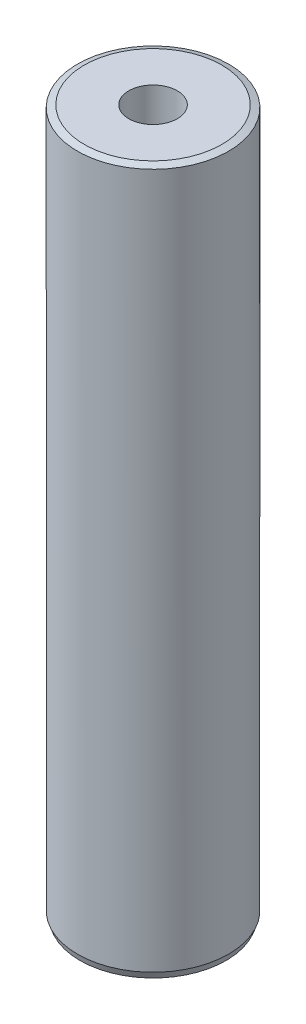
ISO-10303-21;
HEADER;
FILE_DESCRIPTION(('STEP AP214'),'2;1');
FILE_NAME('part.step','',(''),(''),'','','');
FILE_SCHEMA(('AUTOMOTIVE_DESIGN { 1 0 10303 214 1 1 1 1 }'));
ENDSEC;
DATA;
#1=APPLICATION_CONTEXT('core data for automotive mechanical design processes');
#2=APPLICATION_PROTOCOL_DEFINITION('international standard','automotive_design',2000,#1);
#3=PRODUCT_CONTEXT('',#1,'mechanical');
#4=PRODUCT('Part','Part','',(#3));
#5=PRODUCT_RELATED_PRODUCT_CATEGORY('part','',(#4));
#6=PRODUCT_DEFINITION_FORMATION('','',#4);
#7=PRODUCT_DEFINITION_CONTEXT('part definition',#1,'design');
#8=PRODUCT_DEFINITION('design','',#6,#7);
#9=PRODUCT_DEFINITION_SHAPE('','',#8);
#10=(LENGTH_UNIT() NAMED_UNIT(*) SI_UNIT(.MILLI.,.METRE.));
#11=(NAMED_UNIT(*) PLANE_ANGLE_UNIT() SI_UNIT($,.RADIAN.));
#12=(NAMED_UNIT(*) SI_UNIT($,.STERADIAN.) SOLID_ANGLE_UNIT());
#13=UNCERTAINTY_MEASURE_WITH_UNIT(LENGTH_MEASURE(1.E-05),#10,'distance_accuracy_value','');
#14=(GEOMETRIC_REPRESENTATION_CONTEXT(3) GLOBAL_UNCERTAINTY_ASSIGNED_CONTEXT((#13)) GLOBAL_UNIT_ASSIGNED_CONTEXT((#10,
#11,#12)) REPRESENTATION_CONTEXT('',''));
#15=CARTESIAN_POINT('',(0.,0.,0.));
#16=DIRECTION('',(0.,0.,1.));
#17=DIRECTION('',(1.,0.,0.));
#18=AXIS2_PLACEMENT_3D('',#15,#16,#17);
#19=CARTESIAN_POINT('',(0.,442.975530830093,0.));
#20=DIRECTION('',(0.,-1.,0.));
#21=DIRECTION('',(0.,0.,-1.));
#22=AXIS2_PLACEMENT_3D('',#19,#20,#21);
#23=CYLINDRICAL_SURFACE('',#22,47.5);
#24=CARTESIAN_POINT('',(0.,441.413450480086,0.));
#25=DIRECTION('',(0.,1.,0.));
#26=DIRECTION('',(0.,0.,1.));
#27=AXIS2_PLACEMENT_3D('',#24,#25,#26);
#28=CIRCLE('',#27,47.5);
#29=CARTESIAN_POINT('',(0.,441.413450480086,-47.5000000000001));
#30=VERTEX_POINT('',#29);
#31=EDGE_CURVE('E50',#30,#30,#28,.F.);
#32=ORIENTED_EDGE('',*,*,#31,.T.);
#33=EDGE_LOOP('',(#32));
#34=FACE_BOUND('',#33,.T.);
#35=CARTESIAN_POINT('',(0.,4.25407893752877,0.));
#36=DIRECTION('',(0.,1.,0.));
#37=DIRECTION('',(0.,0.,1.));
#38=AXIS2_PLACEMENT_3D('',#35,#36,#37);
#39=CIRCLE('',#38,47.5);
#40=CARTESIAN_POINT('',(0.,4.25407893752877,47.5));
#41=VERTEX_POINT('',#40);
#42=EDGE_CURVE('E51',#41,#41,#39,.T.);
#43=ORIENTED_EDGE('',*,*,#42,.T.);
#44=EDGE_LOOP('',(#43));
#45=FACE_BOUND('',#44,.T.);
#46=ADVANCED_FACE('F39',(#34,#45),#23,.T.);
#47=CARTESIAN_POINT('',(0.,442.975530830093,0.));
#48=DIRECTION('',(0.,1.,0.));
#49=DIRECTION('',(0.,0.,1.));
#50=AXIS2_PLACEMENT_3D('',#47,#48,#49);
#51=PLANE('',#50);
#52=CARTESIAN_POINT('',(0.,442.975530830093,0.));
#53=DIRECTION('',(0.,1.,0.));
#54=DIRECTION('',(0.,0.,1.));
#55=AXIS2_PLACEMENT_3D('',#52,#53,#54);
#56=CIRCLE('',#55,43.2459210624717);
#57=CARTESIAN_POINT('',(0.,442.975530830093,-43.2459210624718));
#58=VERTEX_POINT('',#57);
#59=EDGE_CURVE('E54',#58,#58,#56,.T.);
#60=ORIENTED_EDGE('',*,*,#59,.T.);
#61=EDGE_LOOP('',(#60));
#62=FACE_BOUND('',#61,.T.);
#63=CARTESIAN_POINT('',(0.,442.975530830093,0.));
#64=DIRECTION('',(0.,1.,0.));
#65=DIRECTION('',(0.,0.,1.));
#66=AXIS2_PLACEMENT_3D('',#63,#64,#65);
#67=CIRCLE('',#66,15.2539381624958);
#68=CARTESIAN_POINT('',(0.,442.975530830093,15.2539381624958));
#69=VERTEX_POINT('',#68);
#70=EDGE_CURVE('E58',#69,#69,#67,.T.);
#71=ORIENTED_EDGE('',*,*,#70,.F.);
#72=EDGE_LOOP('',(#71));
#73=FACE_BOUND('',#72,.T.);
#74=ADVANCED_FACE('F69',(#62,#73),#51,.T.);
#75=CARTESIAN_POINT('',(0.,0.,0.));
#76=DIRECTION('',(0.,1.,0.));
#77=DIRECTION('',(0.,0.,1.));
#78=AXIS2_PLACEMENT_3D('',#75,#76,#77);
#79=PLANE('',#78);
#80=CARTESIAN_POINT('',(0.,0.,0.));
#81=DIRECTION('',(0.,1.,0.));
#82=DIRECTION('',(0.,0.,1.));
#83=AXIS2_PLACEMENT_3D('',#80,#81,#82);
#84=CIRCLE('',#83,45.9379196499927);
#85=CARTESIAN_POINT('',(0.,0.,45.9379196499927));
#86=VERTEX_POINT('',#85);
#87=EDGE_CURVE('E10',#86,#86,#84,.F.);
#88=ORIENTED_EDGE('',*,*,#87,.T.);
#89=EDGE_LOOP('',(#88));
#90=FACE_BOUND('',#89,.T.);
#91=CARTESIAN_POINT('',(0.,0.,0.));
#92=DIRECTION('',(0.,1.,0.));
#93=DIRECTION('',(0.,0.,1.));
#94=AXIS2_PLACEMENT_3D('',#91,#92,#93);
#95=CIRCLE('',#94,15.2539381624958);
#96=CARTESIAN_POINT('',(0.,0.,15.2539381624958));
#97=VERTEX_POINT('',#96);
#98=EDGE_CURVE('E63',#97,#97,#95,.T.);
#99=ORIENTED_EDGE('',*,*,#98,.T.);
#100=EDGE_LOOP('',(#99));
#101=FACE_BOUND('',#100,.T.);
#102=ADVANCED_FACE('F75',(#90,#101),#79,.F.);
#103=CARTESIAN_POINT('',(0.,442.975530830093,0.));
#104=DIRECTION('',(0.,-1.,0.));
#105=DIRECTION('',(0.,0.,-1.));
#106=AXIS2_PLACEMENT_3D('',#103,#104,#105);
#107=CYLINDRICAL_SURFACE('',#106,15.2539381624958);
#108=ORIENTED_EDGE('',*,*,#70,.T.);
#109=EDGE_LOOP('',(#108));
#110=FACE_BOUND('',#109,.T.);
#111=ORIENTED_EDGE('',*,*,#98,.F.);
#112=EDGE_LOOP('',(#111));
#113=FACE_BOUND('',#112,.T.);
#114=ADVANCED_FACE('F70',(#110,#113),#107,.F.);
#115=CARTESIAN_POINT('',(0.,442.975530830093,0.));
#116=DIRECTION('',(0.,-1.,0.));
#117=DIRECTION('',(0.,0.,-1.));
#118=AXIS2_PLACEMENT_3D('',#115,#116,#117);
#119=CONICAL_SURFACE('',#118,43.2459210624717,1.21888509817256);
#120=CARTESIAN_POINT('',(0.,441.413450480086,-47.5000000000001));
#121=CARTESIAN_POINT('',(0.,441.429722150399,-47.4556866777342));
#122=CARTESIAN_POINT('',(0.,441.445993820711,-47.4113733554682));
#123=CARTESIAN_POINT('',(0.,441.478537161337,-47.3227467109364));
#124=CARTESIAN_POINT('',(0.,441.494808831649,-47.2784333886705));
#125=CARTESIAN_POINT('',(0.,441.527352172274,-47.1898067441387));
#126=CARTESIAN_POINT('',(0.,441.543623842587,-47.1454934218727));
#127=CARTESIAN_POINT('',(0.,441.576167183212,-47.0568667773409));
#128=CARTESIAN_POINT('',(0.,441.592438853525,-47.012553455075));
#129=CARTESIAN_POINT('',(0.,441.62498219415,-46.9239268105431));
#130=CARTESIAN_POINT('',(0.,441.641253864462,-46.8796134882772));
#131=CARTESIAN_POINT('',(0.,441.673797205088,-46.7909868437454));
#132=CARTESIAN_POINT('',(0.,441.6900688754,-46.7466735214795));
#133=CARTESIAN_POINT('',(0.,441.722612216025,-46.6580468769476));
#134=CARTESIAN_POINT('',(0.,441.738883886338,-46.6137335546817));
#135=CARTESIAN_POINT('',(0.,441.771427226963,-46.5251069101498));
#136=CARTESIAN_POINT('',(0.,441.787698897276,-46.4807935878839));
#137=CARTESIAN_POINT('',(0.,441.820242237901,-46.3921669433521));
#138=CARTESIAN_POINT('',(0.,441.836513908213,-46.3478536210862));
#139=CARTESIAN_POINT('',(0.,441.869057248838,-46.2592269765543));
#140=CARTESIAN_POINT('',(0.,441.885328919151,-46.2149136542884));
#141=CARTESIAN_POINT('',(0.,441.917872259776,-46.1262870097566));
#142=CARTESIAN_POINT('',(0.,441.934143930089,-46.0819736874907));
#143=CARTESIAN_POINT('',(0.,441.966687270714,-45.9933470429588));
#144=CARTESIAN_POINT('',(0.,441.982958941027,-45.9490337206929));
#145=CARTESIAN_POINT('',(0.,442.015502281652,-45.8604070761611));
#146=CARTESIAN_POINT('',(0.,442.031773951964,-45.8160937538951));
#147=CARTESIAN_POINT('',(0.,442.064317292589,-45.7274671093633));
#148=CARTESIAN_POINT('',(0.,442.080588962902,-45.6831537870974));
#149=CARTESIAN_POINT('',(0.,442.113132303527,-45.5945271425655));
#150=CARTESIAN_POINT('',(0.,442.12940397384,-45.5502138202996));
#151=CARTESIAN_POINT('',(0.,442.161947314465,-45.4615871757678));
#152=CARTESIAN_POINT('',(0.,442.178218984777,-45.4172738535019));
#153=CARTESIAN_POINT('',(0.,442.210762325403,-45.32864720897));
#154=CARTESIAN_POINT('',(0.,442.227033995715,-45.2843338867041));
#155=CARTESIAN_POINT('',(0.,442.25957733634,-45.1957072421723));
#156=CARTESIAN_POINT('',(0.,442.275849006653,-45.1513939199063));
#157=CARTESIAN_POINT('',(0.,442.308392347278,-45.0627672753745));
#158=CARTESIAN_POINT('',(0.,442.324664017591,-45.0184539531086));
#159=CARTESIAN_POINT('',(0.,442.357207358216,-44.9298273085767));
#160=CARTESIAN_POINT('',(0.,442.373479028528,-44.8855139863108));
#161=CARTESIAN_POINT('',(0.,442.406022369153,-44.796887341779));
#162=CARTESIAN_POINT('',(0.,442.422294039466,-44.7525740195131));
#163=CARTESIAN_POINT('',(0.,442.454837380091,-44.6639473749812));
#164=CARTESIAN_POINT('',(0.,442.471109050404,-44.6196340527153));
#165=CARTESIAN_POINT('',(0.,442.503652391029,-44.5310074081835));
#166=CARTESIAN_POINT('',(0.,442.519924061341,-44.4866940859175));
#167=CARTESIAN_POINT('',(0.,442.552467401967,-44.3980674413857));
#168=CARTESIAN_POINT('',(0.,442.568739072279,-44.3537541191198));
#169=CARTESIAN_POINT('',(0.,442.601282412904,-44.2651274745879));
#170=CARTESIAN_POINT('',(0.,442.617554083217,-44.220814152322));
#171=CARTESIAN_POINT('',(0.,442.650097423842,-44.1321875077902));
#172=CARTESIAN_POINT('',(0.,442.666369094155,-44.0878741855243));
#173=CARTESIAN_POINT('',(0.,442.69891243478,-43.9992475409924));
#174=CARTESIAN_POINT('',(0.,442.715184105092,-43.9549342187265));
#175=CARTESIAN_POINT('',(0.,442.747727445717,-43.8663075741947));
#176=CARTESIAN_POINT('',(0.,442.76399911603,-43.8219942519287));
#177=CARTESIAN_POINT('',(0.,442.796542456655,-43.7333676073969));
#178=CARTESIAN_POINT('',(0.,442.812814126968,-43.689054285131));
#179=CARTESIAN_POINT('',(0.,442.845357467593,-43.6004276405992));
#180=CARTESIAN_POINT('',(0.,442.861629137905,-43.5561143183332));
#181=CARTESIAN_POINT('',(0.,442.894172478531,-43.4674876738014));
#182=CARTESIAN_POINT('',(0.,442.910444148843,-43.4231743515355));
#183=CARTESIAN_POINT('',(0.,442.942987489468,-43.3345477070036));
#184=CARTESIAN_POINT('',(0.,442.959259159781,-43.2902343847377));
#185=CARTESIAN_POINT('',(0.,442.975530830093,-43.2459210624718));
#186=B_SPLINE_CURVE_WITH_KNOTS('',3,(#120,#121,#122,#123,#124,#125,#126,#127,#128,#129,#130,
#131,#132,#133,#134,#135,#136,#137,#138,#139,#140,#141,#142,#143,#144,#145,#146,#147,#148,#149,
#150,#151,#152,#153,#154,#155,#156,#157,#158,#159,#160,#161,#162,#163,#164,#165,#166,#167,#168,
#169,#170,#171,#172,#173,#174,#175,#176,#177,#178,#179,#180,#181,#182,#183,#184,#185),
.UNSPECIFIED.,.F.,.F.,(4,2,2,2,2,2,2,2,2,2,2,2,2,2,2,2,2,2,2,2,2,2,2,2,2,2,2,2,2,2,2,2,4),(0.,
0.141618996130603,0.283237992261207,0.42485698839181,0.566475984522414,0.708094980653017,
0.849713976783621,0.991332972914212,1.13295196904482,1.27457096517542,1.41618996130602,
1.55780895743663,1.69942795356723,1.84104694969781,1.98266594582842,2.12428494195902,
2.26590393808963,2.40752293422023,2.54914193035084,2.69076092648144,2.83237992261202,
2.97399891874263,3.11561791487323,3.25723691100383,3.39885590713444,3.54047490326504,
3.68209389939563,3.82371289552624,3.96533189165684,4.10695088778744,4.24856988391805,
4.39018888004865,4.53180787617926),.UNSPECIFIED.);
#187=EDGE_CURVE('BSEAM81',#30,#58,#186,.T.);
#188=ORIENTED_EDGE('',*,*,#31,.F.);
#189=ORIENTED_EDGE('',*,*,#59,.F.);
#190=ORIENTED_EDGE('',*,*,#187,.T.);
#191=ORIENTED_EDGE('',*,*,#187,.F.);
#192=EDGE_LOOP('',(#188,#190,#189,#191));
#193=FACE_BOUND('',#192,.T.);
#194=ADVANCED_FACE('F81',(#193),#119,.T.);
#195=CARTESIAN_POINT('',(0.,4.25407893752877,0.));
#196=DIRECTION('',(0.,1.,0.));
#197=DIRECTION('',(0.,0.,1.));
#198=AXIS2_PLACEMENT_3D('',#195,#196,#197);
#199=CONICAL_SURFACE('',#198,47.5,0.35191122862234);
#200=ORIENTED_EDGE('',*,*,#87,.F.);
#201=EDGE_LOOP('',(#200));
#202=FACE_BOUND('',#201,.T.);
#203=ORIENTED_EDGE('',*,*,#42,.F.);
#204=EDGE_LOOP('',(#203));
#205=FACE_BOUND('',#204,.T.);
#206=ADVANCED_FACE('F45',(#202,#205),#199,.T.);
#207=CLOSED_SHELL('',(#46,#74,#102,#114,#194,#206));
#208=MANIFOLD_SOLID_BREP('B2',#207);
#209=ADVANCED_BREP_SHAPE_REPRESENTATION('',(#18,#208),#14);
#210=SHAPE_DEFINITION_REPRESENTATION(#9,#209);
ENDSEC;
END-ISO-10303-21;
